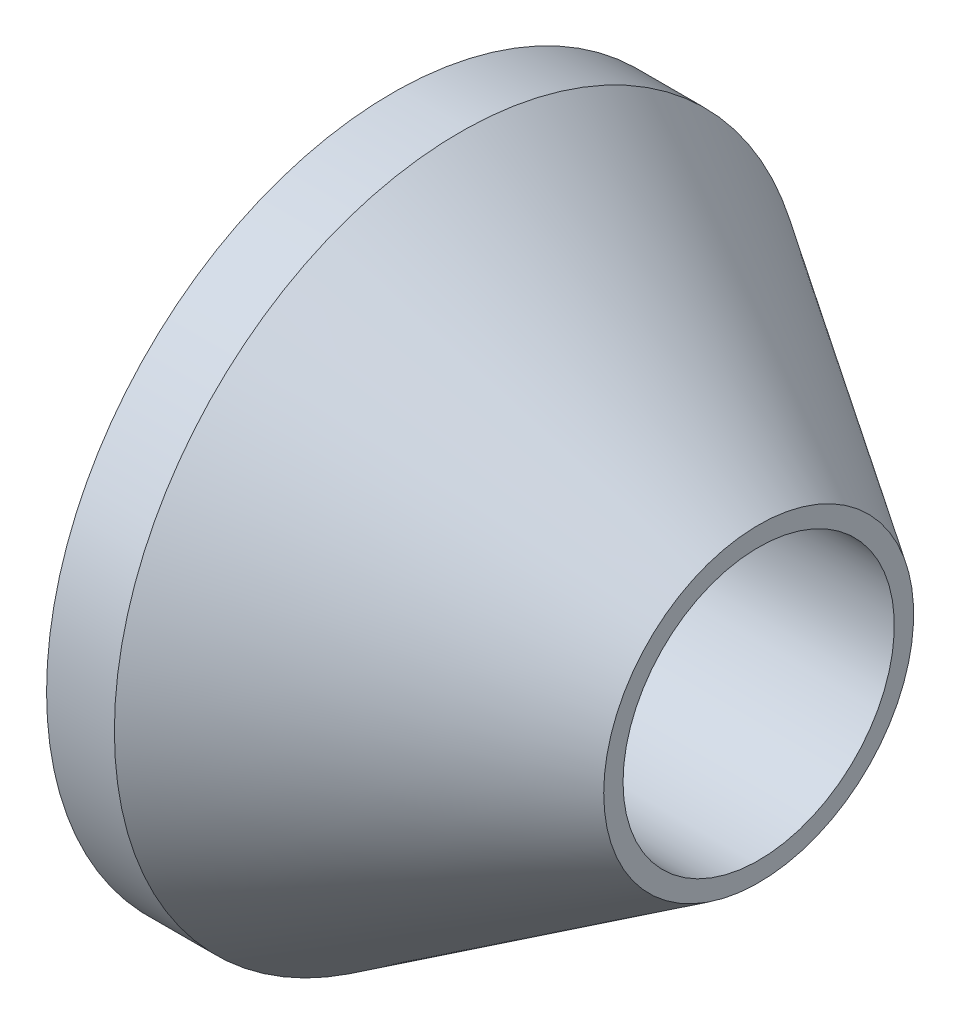
ISO-10303-21;
HEADER;
FILE_DESCRIPTION(('STEP AP214'),'2;1');
FILE_NAME('part.step','',(''),(''),'','','');
FILE_SCHEMA(('AUTOMOTIVE_DESIGN { 1 0 10303 214 1 1 1 1 }'));
ENDSEC;
DATA;
#1=APPLICATION_CONTEXT('core data for automotive mechanical design processes');
#2=APPLICATION_PROTOCOL_DEFINITION('international standard','automotive_design',2000,#1);
#3=PRODUCT_CONTEXT('',#1,'mechanical');
#4=PRODUCT('Part','Part','',(#3));
#5=PRODUCT_RELATED_PRODUCT_CATEGORY('part','',(#4));
#6=PRODUCT_DEFINITION_FORMATION('','',#4);
#7=PRODUCT_DEFINITION_CONTEXT('part definition',#1,'design');
#8=PRODUCT_DEFINITION('design','',#6,#7);
#9=PRODUCT_DEFINITION_SHAPE('','',#8);
#10=(LENGTH_UNIT() NAMED_UNIT(*) SI_UNIT(.MILLI.,.METRE.));
#11=(NAMED_UNIT(*) PLANE_ANGLE_UNIT() SI_UNIT($,.RADIAN.));
#12=(NAMED_UNIT(*) SI_UNIT($,.STERADIAN.) SOLID_ANGLE_UNIT());
#13=UNCERTAINTY_MEASURE_WITH_UNIT(LENGTH_MEASURE(1.E-05),#10,'distance_accuracy_value','');
#14=(GEOMETRIC_REPRESENTATION_CONTEXT(3) GLOBAL_UNCERTAINTY_ASSIGNED_CONTEXT((#13)) GLOBAL_UNIT_ASSIGNED_CONTEXT((#10,
#11,#12)) REPRESENTATION_CONTEXT('',''));
#15=CARTESIAN_POINT('',(0.,0.,0.));
#16=DIRECTION('',(0.,0.,1.));
#17=DIRECTION('',(1.,0.,0.));
#18=AXIS2_PLACEMENT_3D('',#15,#16,#17);
#19=CARTESIAN_POINT('',(0.,0.,-4.57));
#20=DIRECTION('',(-1.,0.,0.));
#21=DIRECTION('',(0.,0.,1.));
#22=AXIS2_PLACEMENT_3D('',#19,#20,#21);
#23=PLANE('',#22);
#24=CARTESIAN_POINT('',(0.,0.,0.));
#25=DIRECTION('',(-1.,0.,0.));
#26=DIRECTION('',(0.,0.,1.));
#27=AXIS2_PLACEMENT_3D('',#24,#25,#26);
#28=CIRCLE('',#27,4.57);
#29=CARTESIAN_POINT('',(0.,0.,4.57));
#30=VERTEX_POINT('',#29);
#31=EDGE_CURVE('E47',#30,#30,#28,.T.);
#32=ORIENTED_EDGE('',*,*,#31,.F.);
#33=EDGE_LOOP('',(#32));
#34=FACE_BOUND('',#33,.T.);
#35=CARTESIAN_POINT('',(0.,0.,0.));
#36=DIRECTION('',(-1.,0.,0.));
#37=DIRECTION('',(0.,0.,1.));
#38=AXIS2_PLACEMENT_3D('',#35,#36,#37);
#39=CIRCLE('',#38,4.);
#40=CARTESIAN_POINT('',(0.,0.,4.));
#41=VERTEX_POINT('',#40);
#42=EDGE_CURVE('E10',#41,#41,#39,.T.);
#43=ORIENTED_EDGE('',*,*,#42,.T.);
#44=EDGE_LOOP('',(#43));
#45=FACE_BOUND('',#44,.T.);
#46=ADVANCED_FACE('F28',(#34,#45),#23,.F.);
#47=CARTESIAN_POINT('',(-6.,0.,0.));
#48=DIRECTION('',(-1.,0.,0.));
#49=DIRECTION('',(0.,0.,1.));
#50=AXIS2_PLACEMENT_3D('',#47,#48,#49);
#51=CYLINDRICAL_SURFACE('',#50,4.);
#52=ORIENTED_EDGE('',*,*,#42,.F.);
#53=EDGE_LOOP('',(#52));
#54=FACE_BOUND('',#53,.T.);
#55=CARTESIAN_POINT('',(-6.,0.,0.));
#56=DIRECTION('',(-1.,0.,0.));
#57=DIRECTION('',(0.,0.,1.));
#58=AXIS2_PLACEMENT_3D('',#55,#56,#57);
#59=CIRCLE('',#58,4.);
#60=CARTESIAN_POINT('',(-6.,0.,4.));
#61=VERTEX_POINT('',#60);
#62=EDGE_CURVE('E34',#61,#61,#59,.T.);
#63=ORIENTED_EDGE('',*,*,#62,.T.);
#64=EDGE_LOOP('',(#63));
#65=FACE_BOUND('',#64,.T.);
#66=ADVANCED_FACE('F54',(#54,#65),#51,.F.);
#67=CARTESIAN_POINT('',(-6.,0.,-4.));
#68=DIRECTION('',(-1.,0.,0.));
#69=DIRECTION('',(0.,0.,1.));
#70=AXIS2_PLACEMENT_3D('',#67,#68,#69);
#71=PLANE('',#70);
#72=ORIENTED_EDGE('',*,*,#62,.F.);
#73=EDGE_LOOP('',(#72));
#74=FACE_BOUND('',#73,.T.);
#75=ADVANCED_FACE('F58',(#74),#71,.F.);
#76=CARTESIAN_POINT('',(-10.8,0.,-10.2));
#77=DIRECTION('',(1.,0.,0.));
#78=DIRECTION('',(0.,0.,-1.));
#79=AXIS2_PLACEMENT_3D('',#76,#77,#78);
#80=PLANE('',#79);
#81=CARTESIAN_POINT('',(-10.8,0.,0.));
#82=DIRECTION('',(-1.,0.,0.));
#83=DIRECTION('',(0.,0.,1.));
#84=AXIS2_PLACEMENT_3D('',#81,#82,#83);
#85=CIRCLE('',#84,10.2);
#86=CARTESIAN_POINT('',(-10.8,0.,10.2));
#87=VERTEX_POINT('',#86);
#88=EDGE_CURVE('E38',#87,#87,#85,.T.);
#89=ORIENTED_EDGE('',*,*,#88,.T.);
#90=EDGE_LOOP('',(#89));
#91=FACE_BOUND('',#90,.T.);
#92=ADVANCED_FACE('F63',(#91),#80,.F.);
#93=CARTESIAN_POINT('',(-6.,0.,0.));
#94=DIRECTION('',(-1.,0.,0.));
#95=DIRECTION('',(0.,0.,1.));
#96=AXIS2_PLACEMENT_3D('',#93,#94,#95);
#97=CYLINDRICAL_SURFACE('',#96,10.2);
#98=ORIENTED_EDGE('',*,*,#88,.F.);
#99=EDGE_LOOP('',(#98));
#100=FACE_BOUND('',#99,.T.);
#101=CARTESIAN_POINT('',(-8.8,0.,0.));
#102=DIRECTION('',(-1.,0.,0.));
#103=DIRECTION('',(0.,0.,1.));
#104=AXIS2_PLACEMENT_3D('',#101,#102,#103);
#105=CIRCLE('',#104,10.2);
#106=CARTESIAN_POINT('',(-8.8,0.,10.2));
#107=VERTEX_POINT('',#106);
#108=EDGE_CURVE('E42',#107,#107,#105,.T.);
#109=ORIENTED_EDGE('',*,*,#108,.T.);
#110=EDGE_LOOP('',(#109));
#111=FACE_BOUND('',#110,.T.);
#112=ADVANCED_FACE('F69',(#100,#111),#97,.T.);
#113=CARTESIAN_POINT('',(0.,0.,0.));
#114=DIRECTION('',(-1.,0.,0.));
#115=DIRECTION('',(0.,0.,1.));
#116=AXIS2_PLACEMENT_3D('',#113,#114,#115);
#117=CONICAL_SURFACE('',#116,4.57,0.569151942392049);
#118=ORIENTED_EDGE('',*,*,#108,.F.);
#119=EDGE_LOOP('',(#118));
#120=FACE_BOUND('',#119,.T.);
#121=ORIENTED_EDGE('',*,*,#31,.T.);
#122=EDGE_LOOP('',(#121));
#123=FACE_BOUND('',#122,.T.);
#124=ADVANCED_FACE('F51',(#120,#123),#117,.T.);
#125=CLOSED_SHELL('',(#46,#66,#75,#92,#112,#124));
#126=MANIFOLD_SOLID_BREP('B2',#125);
#127=ADVANCED_BREP_SHAPE_REPRESENTATION('',(#18,#126),#14);
#128=SHAPE_DEFINITION_REPRESENTATION(#9,#127);
ENDSEC;
END-ISO-10303-21;
